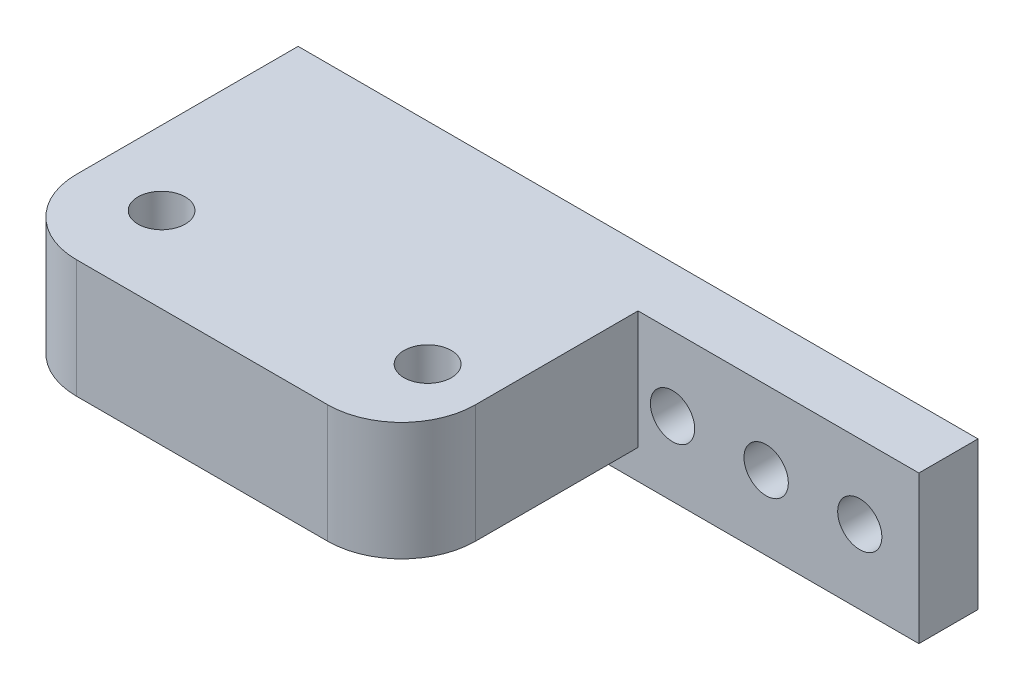
ISO-10303-21;
HEADER;
FILE_DESCRIPTION(('STEP AP214'),'2;1');
FILE_NAME('part.step','',(''),(''),'','','');
FILE_SCHEMA(('AUTOMOTIVE_DESIGN { 1 0 10303 214 1 1 1 1 }'));
ENDSEC;
DATA;
#1=APPLICATION_CONTEXT('core data for automotive mechanical design processes');
#2=APPLICATION_PROTOCOL_DEFINITION('international standard','automotive_design',2000,#1);
#3=PRODUCT_CONTEXT('',#1,'mechanical');
#4=PRODUCT('Part','Part','',(#3));
#5=PRODUCT_RELATED_PRODUCT_CATEGORY('part','',(#4));
#6=PRODUCT_DEFINITION_FORMATION('','',#4);
#7=PRODUCT_DEFINITION_CONTEXT('part definition',#1,'design');
#8=PRODUCT_DEFINITION('design','',#6,#7);
#9=PRODUCT_DEFINITION_SHAPE('','',#8);
#10=(LENGTH_UNIT() NAMED_UNIT(*) SI_UNIT(.MILLI.,.METRE.));
#11=(NAMED_UNIT(*) PLANE_ANGLE_UNIT() SI_UNIT($,.RADIAN.));
#12=(NAMED_UNIT(*) SI_UNIT($,.STERADIAN.) SOLID_ANGLE_UNIT());
#13=UNCERTAINTY_MEASURE_WITH_UNIT(LENGTH_MEASURE(1.E-05),#10,'distance_accuracy_value','');
#14=(GEOMETRIC_REPRESENTATION_CONTEXT(3) GLOBAL_UNCERTAINTY_ASSIGNED_CONTEXT((#13)) GLOBAL_UNIT_ASSIGNED_CONTEXT((#10,
#11,#12)) REPRESENTATION_CONTEXT('',''));
#15=CARTESIAN_POINT('',(0.,0.,0.));
#16=DIRECTION('',(0.,0.,1.));
#17=DIRECTION('',(1.,0.,0.));
#18=AXIS2_PLACEMENT_3D('',#15,#16,#17);
#19=CARTESIAN_POINT('',(0.,0.,4.));
#20=DIRECTION('',(0.,1.,0.));
#21=DIRECTION('',(0.,0.,1.));
#22=AXIS2_PLACEMENT_3D('',#19,#20,#21);
#23=PLANE('',#22);
#24=DIRECTION('',(1.,0.,0.));
#25=VECTOR('',#24,1.);
#26=CARTESIAN_POINT('',(0.,0.,0.));
#27=LINE('',#26,#25);
#28=CARTESIAN_POINT('',(0.,0.,0.));
#29=VERTEX_POINT('',#28);
#30=CARTESIAN_POINT('',(46.,0.,0.));
#31=VERTEX_POINT('',#30);
#32=EDGE_CURVE('E134',#29,#31,#27,.T.);
#33=ORIENTED_EDGE('',*,*,#32,.T.);
#34=DIRECTION('',(0.,0.,-1.));
#35=VECTOR('',#34,1.);
#36=CARTESIAN_POINT('',(46.,0.,4.));
#37=LINE('',#36,#35);
#38=CARTESIAN_POINT('',(46.,0.,4.));
#39=VERTEX_POINT('',#38);
#40=EDGE_CURVE('E160',#39,#31,#37,.T.);
#41=ORIENTED_EDGE('',*,*,#40,.F.);
#42=DIRECTION('',(1.,0.,0.));
#43=VECTOR('',#42,1.);
#44=CARTESIAN_POINT('',(0.,0.,4.));
#45=LINE('',#44,#43);
#46=CARTESIAN_POINT('',(0.,0.,4.));
#47=VERTEX_POINT('',#46);
#48=EDGE_CURVE('E135',#47,#39,#45,.T.);
#49=ORIENTED_EDGE('',*,*,#48,.F.);
#50=DIRECTION('',(0.,0.,-1.));
#51=VECTOR('',#50,1.);
#52=CARTESIAN_POINT('',(0.,0.,4.));
#53=LINE('',#52,#51);
#54=EDGE_CURVE('E144',#47,#29,#53,.T.);
#55=ORIENTED_EDGE('',*,*,#54,.T.);
#56=EDGE_LOOP('',(#33,#41,#49,#55));
#57=FACE_BOUND('',#56,.T.);
#58=ADVANCED_FACE('F33',(#57),#23,.F.);
#59=CARTESIAN_POINT('',(46.,0.,4.));
#60=DIRECTION('',(-1.,0.,0.));
#61=DIRECTION('',(0.,-1.,0.));
#62=AXIS2_PLACEMENT_3D('',#59,#60,#61);
#63=PLANE('',#62);
#64=DIRECTION('',(0.,1.,0.));
#65=VECTOR('',#64,1.);
#66=CARTESIAN_POINT('',(46.,0.,0.));
#67=LINE('',#66,#65);
#68=CARTESIAN_POINT('',(46.,10.,0.));
#69=VERTEX_POINT('',#68);
#70=EDGE_CURVE('E147',#31,#69,#67,.T.);
#71=ORIENTED_EDGE('',*,*,#70,.T.);
#72=DIRECTION('',(0.,0.,-1.));
#73=VECTOR('',#72,1.);
#74=CARTESIAN_POINT('',(46.,10.,4.));
#75=LINE('',#74,#73);
#76=CARTESIAN_POINT('',(46.,10.,4.));
#77=VERTEX_POINT('',#76);
#78=EDGE_CURVE('E158',#77,#69,#75,.T.);
#79=ORIENTED_EDGE('',*,*,#78,.F.);
#80=DIRECTION('',(0.,1.,0.));
#81=VECTOR('',#80,1.);
#82=CARTESIAN_POINT('',(46.,0.,4.));
#83=LINE('',#82,#81);
#84=EDGE_CURVE('E138',#39,#77,#83,.T.);
#85=ORIENTED_EDGE('',*,*,#84,.F.);
#86=ORIENTED_EDGE('',*,*,#40,.T.);
#87=EDGE_LOOP('',(#71,#79,#85,#86));
#88=FACE_BOUND('',#87,.T.);
#89=ADVANCED_FACE('F201',(#88),#63,.F.);
#90=CARTESIAN_POINT('',(0.,10.,4.));
#91=DIRECTION('',(0.,1.,0.));
#92=DIRECTION('',(0.,0.,1.));
#93=AXIS2_PLACEMENT_3D('',#90,#91,#92);
#94=PLANE('',#93);
#95=CARTESIAN_POINT('',(22.999560123497,10.,14.2359301666111));
#96=DIRECTION('',(0.,1.,0.));
#97=DIRECTION('',(0.,0.,1.));
#98=AXIS2_PLACEMENT_3D('',#95,#96,#97);
#99=CIRCLE('',#98,1.6009934289539);
#100=CARTESIAN_POINT('',(22.999560123497,10.,15.836923595565));
#101=VERTEX_POINT('',#100);
#102=EDGE_CURVE('E123',#101,#101,#99,.T.);
#103=ORIENTED_EDGE('',*,*,#102,.F.);
#104=EDGE_LOOP('',(#103));
#105=FACE_BOUND('',#104,.T.);
#106=CARTESIAN_POINT('',(5.0014415528665,10.,14.2376154244188));
#107=DIRECTION('',(0.,1.,0.));
#108=DIRECTION('',(0.,0.,1.));
#109=AXIS2_PLACEMENT_3D('',#106,#107,#108);
#110=CIRCLE('',#109,1.59816028140298);
#111=CARTESIAN_POINT('',(5.0014415528665,10.,15.8357757058218));
#112=VERTEX_POINT('',#111);
#113=EDGE_CURVE('E126',#112,#112,#110,.T.);
#114=ORIENTED_EDGE('',*,*,#113,.F.);
#115=EDGE_LOOP('',(#114));
#116=FACE_BOUND('',#115,.T.);
#117=DIRECTION('',(-1.,0.,0.));
#118=VECTOR('',#117,1.);
#119=CARTESIAN_POINT('',(0.,10.,20.));
#120=LINE('',#119,#118);
#121=CARTESIAN_POINT('',(22.,10.,20.));
#122=VERTEX_POINT('',#121);
#123=CARTESIAN_POINT('',(4.99999999999999,10.,20.));
#124=VERTEX_POINT('',#123);
#125=EDGE_CURVE('E129',#122,#124,#120,.T.);
#126=ORIENTED_EDGE('',*,*,#125,.F.);
#127=CARTESIAN_POINT('',(22.,10.,15.));
#128=DIRECTION('',(0.,1.,0.));
#129=DIRECTION('',(0.,0.,1.));
#130=AXIS2_PLACEMENT_3D('',#127,#128,#129);
#131=CIRCLE('',#130,5.);
#132=CARTESIAN_POINT('',(27.,10.,15.));
#133=VERTEX_POINT('',#132);
#134=EDGE_CURVE('E171',#122,#133,#131,.T.);
#135=ORIENTED_EDGE('',*,*,#134,.T.);
#136=DIRECTION('',(0.,0.,-1.));
#137=VECTOR('',#136,1.);
#138=CARTESIAN_POINT('',(27.,10.,20.));
#139=LINE('',#138,#137);
#140=CARTESIAN_POINT('',(27.,10.,4.));
#141=VERTEX_POINT('',#140);
#142=EDGE_CURVE('E109',#133,#141,#139,.T.);
#143=ORIENTED_EDGE('',*,*,#142,.T.);
#144=DIRECTION('',(1.,0.,0.));
#145=VECTOR('',#144,1.);
#146=CARTESIAN_POINT('',(0.,10.,4.));
#147=LINE('',#146,#145);
#148=EDGE_CURVE('E119',#141,#77,#147,.T.);
#149=ORIENTED_EDGE('',*,*,#148,.T.);
#150=ORIENTED_EDGE('',*,*,#78,.T.);
#151=DIRECTION('',(1.,0.,0.));
#152=VECTOR('',#151,1.);
#153=CARTESIAN_POINT('',(0.,10.,0.));
#154=LINE('',#153,#152);
#155=CARTESIAN_POINT('',(0.,10.,0.));
#156=VERTEX_POINT('',#155);
#157=EDGE_CURVE('E150',#156,#69,#154,.T.);
#158=ORIENTED_EDGE('',*,*,#157,.F.);
#159=DIRECTION('',(0.,0.,-1.));
#160=VECTOR('',#159,1.);
#161=CARTESIAN_POINT('',(0.,10.,4.));
#162=LINE('',#161,#160);
#163=CARTESIAN_POINT('',(0.,10.,15.));
#164=VERTEX_POINT('',#163);
#165=EDGE_CURVE('E156',#164,#156,#162,.T.);
#166=ORIENTED_EDGE('',*,*,#165,.F.);
#167=CARTESIAN_POINT('',(4.99999999999999,10.,15.));
#168=DIRECTION('',(0.,1.,0.));
#169=DIRECTION('',(0.,0.,1.));
#170=AXIS2_PLACEMENT_3D('',#167,#168,#169);
#171=CIRCLE('',#170,5.);
#172=EDGE_CURVE('E169',#164,#124,#171,.T.);
#173=ORIENTED_EDGE('',*,*,#172,.T.);
#174=EDGE_LOOP('',(#126,#135,#143,#149,#150,#158,#166,#173));
#175=FACE_BOUND('',#174,.T.);
#176=ADVANCED_FACE('F184',(#105,#116,#175),#94,.T.);
#177=CARTESIAN_POINT('',(0.,0.,4.));
#178=DIRECTION('',(-1.,0.,0.));
#179=DIRECTION('',(0.,-1.,0.));
#180=AXIS2_PLACEMENT_3D('',#177,#178,#179);
#181=PLANE('',#180);
#182=DIRECTION('',(0.,0.,-1.));
#183=VECTOR('',#182,1.);
#184=CARTESIAN_POINT('',(0.,2.,20.));
#185=LINE('',#184,#183);
#186=CARTESIAN_POINT('',(0.,2.,15.));
#187=VERTEX_POINT('',#186);
#188=CARTESIAN_POINT('',(0.,2.,4.));
#189=VERTEX_POINT('',#188);
#190=EDGE_CURVE('E108',#187,#189,#185,.T.);
#191=ORIENTED_EDGE('',*,*,#190,.F.);
#192=DIRECTION('',(0.,-1.,0.));
#193=VECTOR('',#192,1.);
#194=CARTESIAN_POINT('',(0.,0.,15.));
#195=LINE('',#194,#193);
#196=EDGE_CURVE('E11',#187,#164,#195,.F.);
#197=ORIENTED_EDGE('',*,*,#196,.T.);
#198=ORIENTED_EDGE('',*,*,#165,.T.);
#199=DIRECTION('',(0.,1.,0.));
#200=VECTOR('',#199,1.);
#201=CARTESIAN_POINT('',(0.,0.,0.));
#202=LINE('',#201,#200);
#203=EDGE_CURVE('E139',#29,#156,#202,.T.);
#204=ORIENTED_EDGE('',*,*,#203,.F.);
#205=ORIENTED_EDGE('',*,*,#54,.F.);
#206=DIRECTION('',(0.,1.,0.));
#207=VECTOR('',#206,1.);
#208=CARTESIAN_POINT('',(0.,0.,4.));
#209=LINE('',#208,#207);
#210=EDGE_CURVE('E142',#47,#189,#209,.T.);
#211=ORIENTED_EDGE('',*,*,#210,.T.);
#212=EDGE_LOOP('',(#191,#197,#198,#204,#205,#211));
#213=FACE_BOUND('',#212,.T.);
#214=ADVANCED_FACE('F190',(#213),#181,.T.);
#215=CARTESIAN_POINT('',(0.,0.,4.));
#216=DIRECTION('',(0.,0.,1.));
#217=DIRECTION('',(1.,0.,0.));
#218=AXIS2_PLACEMENT_3D('',#215,#216,#217);
#219=PLANE('',#218);
#220=CARTESIAN_POINT('',(41.9999999999998,5.00000000000299,4.));
#221=DIRECTION('',(0.,0.,1.));
#222=DIRECTION('',(1.,0.,0.));
#223=AXIS2_PLACEMENT_3D('',#220,#221,#222);
#224=CIRCLE('',#223,1.49482083831928);
#225=CARTESIAN_POINT('',(43.4948208383191,5.00000000000299,4.));
#226=VERTEX_POINT('',#225);
#227=EDGE_CURVE('E372',#226,#226,#224,.T.);
#228=ORIENTED_EDGE('',*,*,#227,.F.);
#229=EDGE_LOOP('',(#228));
#230=FACE_BOUND('',#229,.T.);
#231=CARTESIAN_POINT('',(29.3333333333331,5.00000000000299,4.));
#232=DIRECTION('',(0.,0.,1.));
#233=DIRECTION('',(1.,0.,0.));
#234=AXIS2_PLACEMENT_3D('',#231,#232,#233);
#235=CIRCLE('',#234,1.49999999999984);
#236=CARTESIAN_POINT('',(30.833333333333,5.00000000000299,4.));
#237=VERTEX_POINT('',#236);
#238=EDGE_CURVE('E369',#237,#237,#235,.T.);
#239=ORIENTED_EDGE('',*,*,#238,.F.);
#240=EDGE_LOOP('',(#239));
#241=FACE_BOUND('',#240,.T.);
#242=CARTESIAN_POINT('',(35.6666666666664,5.00000000000299,4.));
#243=DIRECTION('',(0.,0.,1.));
#244=DIRECTION('',(1.,0.,0.));
#245=AXIS2_PLACEMENT_3D('',#242,#243,#244);
#246=CIRCLE('',#245,1.49999999999985);
#247=CARTESIAN_POINT('',(37.1666666666663,5.00000000000299,4.));
#248=VERTEX_POINT('',#247);
#249=EDGE_CURVE('E366',#248,#248,#246,.T.);
#250=ORIENTED_EDGE('',*,*,#249,.F.);
#251=EDGE_LOOP('',(#250));
#252=FACE_BOUND('',#251,.T.);
#253=DIRECTION('',(0.,1.,0.));
#254=VECTOR('',#253,1.);
#255=CARTESIAN_POINT('',(27.,10.,4.));
#256=LINE('',#255,#254);
#257=CARTESIAN_POINT('',(27.,2.,4.));
#258=VERTEX_POINT('',#257);
#259=EDGE_CURVE('E105',#258,#141,#256,.T.);
#260=ORIENTED_EDGE('',*,*,#259,.F.);
#261=DIRECTION('',(1.,0.,0.));
#262=VECTOR('',#261,1.);
#263=CARTESIAN_POINT('',(0.,2.,4.));
#264=LINE('',#263,#262);
#265=EDGE_CURVE('E116',#189,#258,#264,.T.);
#266=ORIENTED_EDGE('',*,*,#265,.F.);
#267=ORIENTED_EDGE('',*,*,#210,.F.);
#268=ORIENTED_EDGE('',*,*,#48,.T.);
#269=ORIENTED_EDGE('',*,*,#84,.T.);
#270=ORIENTED_EDGE('',*,*,#148,.F.);
#271=EDGE_LOOP('',(#260,#266,#267,#268,#269,#270));
#272=FACE_BOUND('',#271,.T.);
#273=ADVANCED_FACE('F114',(#230,#241,#252,#272),#219,.T.);
#274=CARTESIAN_POINT('',(0.,0.,0.));
#275=DIRECTION('',(0.,0.,1.));
#276=DIRECTION('',(1.,0.,0.));
#277=AXIS2_PLACEMENT_3D('',#274,#275,#276);
#278=PLANE('',#277);
#279=CARTESIAN_POINT('',(41.9999999999998,5.00000000000299,0.));
#280=DIRECTION('',(0.,0.,-1.));
#281=DIRECTION('',(-1.,0.,0.));
#282=AXIS2_PLACEMENT_3D('',#279,#280,#281);
#283=CIRCLE('',#282,1.49482083831928);
#284=CARTESIAN_POINT('',(40.5051791616805,5.00000000000299,0.));
#285=VERTEX_POINT('',#284);
#286=EDGE_CURVE('E353',#285,#285,#283,.T.);
#287=ORIENTED_EDGE('',*,*,#286,.F.);
#288=EDGE_LOOP('',(#287));
#289=FACE_BOUND('',#288,.T.);
#290=CARTESIAN_POINT('',(29.3333333333331,5.00000000000299,0.));
#291=DIRECTION('',(0.,0.,-1.));
#292=DIRECTION('',(-1.,0.,0.));
#293=AXIS2_PLACEMENT_3D('',#290,#291,#292);
#294=CIRCLE('',#293,1.49999999999984);
#295=CARTESIAN_POINT('',(27.8333333333333,5.00000000000299,0.));
#296=VERTEX_POINT('',#295);
#297=EDGE_CURVE('E357',#296,#296,#294,.T.);
#298=ORIENTED_EDGE('',*,*,#297,.F.);
#299=EDGE_LOOP('',(#298));
#300=FACE_BOUND('',#299,.T.);
#301=CARTESIAN_POINT('',(35.6666666666664,5.00000000000299,0.));
#302=DIRECTION('',(0.,0.,-1.));
#303=DIRECTION('',(-1.,0.,0.));
#304=AXIS2_PLACEMENT_3D('',#301,#302,#303);
#305=CIRCLE('',#304,1.49999999999985);
#306=CARTESIAN_POINT('',(34.1666666666666,5.00000000000299,0.));
#307=VERTEX_POINT('',#306);
#308=EDGE_CURVE('E360',#307,#307,#305,.T.);
#309=ORIENTED_EDGE('',*,*,#308,.F.);
#310=EDGE_LOOP('',(#309));
#311=FACE_BOUND('',#310,.T.);
#312=ORIENTED_EDGE('',*,*,#32,.F.);
#313=ORIENTED_EDGE('',*,*,#203,.T.);
#314=ORIENTED_EDGE('',*,*,#157,.T.);
#315=ORIENTED_EDGE('',*,*,#70,.F.);
#316=EDGE_LOOP('',(#312,#313,#314,#315));
#317=FACE_BOUND('',#316,.T.);
#318=ADVANCED_FACE('F196',(#289,#300,#311,#317),#278,.F.);
#319=CARTESIAN_POINT('',(0.,2.,20.));
#320=DIRECTION('',(0.,1.,0.));
#321=DIRECTION('',(0.,0.,1.));
#322=AXIS2_PLACEMENT_3D('',#319,#320,#321);
#323=PLANE('',#322);
#324=CARTESIAN_POINT('',(22.999560123497,2.,14.2359301666111));
#325=DIRECTION('',(0.,-1.,0.));
#326=DIRECTION('',(0.,0.,-1.));
#327=AXIS2_PLACEMENT_3D('',#324,#325,#326);
#328=CIRCLE('',#327,1.6009934289539);
#329=CARTESIAN_POINT('',(22.999560123497,2.,12.6349367376572));
#330=VERTEX_POINT('',#329);
#331=EDGE_CURVE('E375',#330,#330,#328,.T.);
#332=ORIENTED_EDGE('',*,*,#331,.F.);
#333=EDGE_LOOP('',(#332));
#334=FACE_BOUND('',#333,.T.);
#335=CARTESIAN_POINT('',(5.0014415528665,2.,14.2376154244188));
#336=DIRECTION('',(0.,-1.,0.));
#337=DIRECTION('',(0.,0.,-1.));
#338=AXIS2_PLACEMENT_3D('',#335,#336,#337);
#339=CIRCLE('',#338,1.59816028140298);
#340=CARTESIAN_POINT('',(5.0014415528665,2.,12.6394551430158));
#341=VERTEX_POINT('',#340);
#342=EDGE_CURVE('E374',#341,#341,#339,.T.);
#343=ORIENTED_EDGE('',*,*,#342,.F.);
#344=EDGE_LOOP('',(#343));
#345=FACE_BOUND('',#344,.T.);
#346=DIRECTION('',(0.,0.,-1.));
#347=VECTOR('',#346,1.);
#348=CARTESIAN_POINT('',(27.,2.,20.));
#349=LINE('',#348,#347);
#350=CARTESIAN_POINT('',(27.,2.,15.));
#351=VERTEX_POINT('',#350);
#352=EDGE_CURVE('E102',#351,#258,#349,.T.);
#353=ORIENTED_EDGE('',*,*,#352,.F.);
#354=CARTESIAN_POINT('',(22.,2.,15.));
#355=DIRECTION('',(0.,1.,0.));
#356=DIRECTION('',(0.,0.,1.));
#357=AXIS2_PLACEMENT_3D('',#354,#355,#356);
#358=CIRCLE('',#357,5.);
#359=CARTESIAN_POINT('',(22.,2.,20.));
#360=VERTEX_POINT('',#359);
#361=EDGE_CURVE('E41',#351,#360,#358,.F.);
#362=ORIENTED_EDGE('',*,*,#361,.T.);
#363=DIRECTION('',(1.,0.,0.));
#364=VECTOR('',#363,1.);
#365=CARTESIAN_POINT('',(0.,2.,20.));
#366=LINE('',#365,#364);
#367=CARTESIAN_POINT('',(5.,2.,20.));
#368=VERTEX_POINT('',#367);
#369=EDGE_CURVE('E120',#368,#360,#366,.T.);
#370=ORIENTED_EDGE('',*,*,#369,.F.);
#371=CARTESIAN_POINT('',(5.,2.,15.));
#372=DIRECTION('',(0.,1.,0.));
#373=DIRECTION('',(0.,0.,1.));
#374=AXIS2_PLACEMENT_3D('',#371,#372,#373);
#375=CIRCLE('',#374,5.);
#376=EDGE_CURVE('E48',#368,#187,#375,.F.);
#377=ORIENTED_EDGE('',*,*,#376,.T.);
#378=ORIENTED_EDGE('',*,*,#190,.T.);
#379=ORIENTED_EDGE('',*,*,#265,.T.);
#380=EDGE_LOOP('',(#353,#362,#370,#377,#378,#379));
#381=FACE_BOUND('',#380,.T.);
#382=ADVANCED_FACE('F122',(#334,#345,#381),#323,.F.);
#383=CARTESIAN_POINT('',(27.,10.,20.));
#384=DIRECTION('',(-1.,0.,0.));
#385=DIRECTION('',(0.,0.,1.));
#386=AXIS2_PLACEMENT_3D('',#383,#384,#385);
#387=PLANE('',#386);
#388=ORIENTED_EDGE('',*,*,#142,.F.);
#389=DIRECTION('',(0.,1.,0.));
#390=VECTOR('',#389,1.);
#391=CARTESIAN_POINT('',(27.,2.,15.));
#392=LINE('',#391,#390);
#393=EDGE_CURVE('E56',#133,#351,#392,.F.);
#394=ORIENTED_EDGE('',*,*,#393,.T.);
#395=ORIENTED_EDGE('',*,*,#352,.T.);
#396=ORIENTED_EDGE('',*,*,#259,.T.);
#397=EDGE_LOOP('',(#388,#394,#395,#396));
#398=FACE_BOUND('',#397,.T.);
#399=ADVANCED_FACE('F104',(#398),#387,.F.);
#400=CARTESIAN_POINT('',(0.,0.,20.));
#401=DIRECTION('',(0.,0.,1.));
#402=DIRECTION('',(1.,0.,0.));
#403=AXIS2_PLACEMENT_3D('',#400,#401,#402);
#404=PLANE('',#403);
#405=ORIENTED_EDGE('',*,*,#369,.T.);
#406=DIRECTION('',(0.,1.,0.));
#407=VECTOR('',#406,1.);
#408=CARTESIAN_POINT('',(22.,10.,20.));
#409=LINE('',#408,#407);
#410=EDGE_CURVE('E166',#360,#122,#409,.T.);
#411=ORIENTED_EDGE('',*,*,#410,.T.);
#412=ORIENTED_EDGE('',*,*,#125,.T.);
#413=DIRECTION('',(0.,-1.,0.));
#414=VECTOR('',#413,1.);
#415=CARTESIAN_POINT('',(5.,0.,20.));
#416=LINE('',#415,#414);
#417=EDGE_CURVE('E163',#124,#368,#416,.T.);
#418=ORIENTED_EDGE('',*,*,#417,.T.);
#419=EDGE_LOOP('',(#405,#411,#412,#418));
#420=FACE_BOUND('',#419,.T.);
#421=ADVANCED_FACE('F178',(#420),#404,.T.);
#422=CARTESIAN_POINT('',(5.0014415528665,18.,14.2376154244188));
#423=DIRECTION('',(0.,-1.,0.));
#424=DIRECTION('',(0.,0.,-1.));
#425=AXIS2_PLACEMENT_3D('',#422,#423,#424);
#426=CYLINDRICAL_SURFACE('',#425,1.59816028140298);
#427=ORIENTED_EDGE('',*,*,#113,.T.);
#428=EDGE_LOOP('',(#427));
#429=FACE_BOUND('',#428,.T.);
#430=ORIENTED_EDGE('',*,*,#342,.T.);
#431=EDGE_LOOP('',(#430));
#432=FACE_BOUND('',#431,.T.);
#433=ADVANCED_FACE('F237',(#429,#432),#426,.F.);
#434=CARTESIAN_POINT('',(22.999560123497,18.,14.2359301666111));
#435=DIRECTION('',(0.,-1.,0.));
#436=DIRECTION('',(0.,0.,-1.));
#437=AXIS2_PLACEMENT_3D('',#434,#435,#436);
#438=CYLINDRICAL_SURFACE('',#437,1.6009934289539);
#439=ORIENTED_EDGE('',*,*,#102,.T.);
#440=EDGE_LOOP('',(#439));
#441=FACE_BOUND('',#440,.T.);
#442=ORIENTED_EDGE('',*,*,#331,.T.);
#443=EDGE_LOOP('',(#442));
#444=FACE_BOUND('',#443,.T.);
#445=ADVANCED_FACE('F233',(#441,#444),#438,.F.);
#446=CARTESIAN_POINT('',(35.6666666666664,5.00000000000299,16.));
#447=DIRECTION('',(0.,0.,-1.));
#448=DIRECTION('',(-1.,0.,0.));
#449=AXIS2_PLACEMENT_3D('',#446,#447,#448);
#450=CYLINDRICAL_SURFACE('',#449,1.49999999999985);
#451=ORIENTED_EDGE('',*,*,#249,.T.);
#452=EDGE_LOOP('',(#451));
#453=FACE_BOUND('',#452,.T.);
#454=ORIENTED_EDGE('',*,*,#308,.T.);
#455=EDGE_LOOP('',(#454));
#456=FACE_BOUND('',#455,.T.);
#457=ADVANCED_FACE('F225',(#453,#456),#450,.F.);
#458=CARTESIAN_POINT('',(29.3333333333331,5.00000000000299,16.));
#459=DIRECTION('',(0.,0.,-1.));
#460=DIRECTION('',(-1.,0.,0.));
#461=AXIS2_PLACEMENT_3D('',#458,#459,#460);
#462=CYLINDRICAL_SURFACE('',#461,1.49999999999984);
#463=ORIENTED_EDGE('',*,*,#238,.T.);
#464=EDGE_LOOP('',(#463));
#465=FACE_BOUND('',#464,.T.);
#466=ORIENTED_EDGE('',*,*,#297,.T.);
#467=EDGE_LOOP('',(#466));
#468=FACE_BOUND('',#467,.T.);
#469=ADVANCED_FACE('F219',(#465,#468),#462,.F.);
#470=CARTESIAN_POINT('',(41.9999999999998,5.00000000000299,16.));
#471=DIRECTION('',(0.,0.,-1.));
#472=DIRECTION('',(-1.,0.,0.));
#473=AXIS2_PLACEMENT_3D('',#470,#471,#472);
#474=CYLINDRICAL_SURFACE('',#473,1.49482083831928);
#475=ORIENTED_EDGE('',*,*,#227,.T.);
#476=EDGE_LOOP('',(#475));
#477=FACE_BOUND('',#476,.T.);
#478=ORIENTED_EDGE('',*,*,#286,.T.);
#479=EDGE_LOOP('',(#478));
#480=FACE_BOUND('',#479,.T.);
#481=ADVANCED_FACE('F214',(#477,#480),#474,.F.);
#482=CARTESIAN_POINT('',(22.,0.,15.));
#483=DIRECTION('',(0.,-1.,0.));
#484=DIRECTION('',(0.,0.,-1.));
#485=AXIS2_PLACEMENT_3D('',#482,#483,#484);
#486=CYLINDRICAL_SURFACE('',#485,5.);
#487=ORIENTED_EDGE('',*,*,#361,.F.);
#488=ORIENTED_EDGE('',*,*,#393,.F.);
#489=ORIENTED_EDGE('',*,*,#134,.F.);
#490=ORIENTED_EDGE('',*,*,#410,.F.);
#491=EDGE_LOOP('',(#487,#488,#489,#490));
#492=FACE_BOUND('',#491,.T.);
#493=ADVANCED_FACE('F182',(#492),#486,.T.);
#494=CARTESIAN_POINT('',(5.,0.,15.));
#495=DIRECTION('',(0.,-1.,0.));
#496=DIRECTION('',(1.,0.,0.));
#497=AXIS2_PLACEMENT_3D('',#494,#495,#496);
#498=CYLINDRICAL_SURFACE('',#497,5.);
#499=ORIENTED_EDGE('',*,*,#172,.F.);
#500=ORIENTED_EDGE('',*,*,#196,.F.);
#501=ORIENTED_EDGE('',*,*,#376,.F.);
#502=ORIENTED_EDGE('',*,*,#417,.F.);
#503=EDGE_LOOP('',(#499,#500,#501,#502));
#504=FACE_BOUND('',#503,.T.);
#505=ADVANCED_FACE('F35',(#504),#498,.T.);
#506=CLOSED_SHELL('',(#58,#89,#176,#214,#273,#318,#382,#399,#421,#433,#445,#457,#469,#481,#493,#505));
#507=MANIFOLD_SOLID_BREP('B2',#506);
#508=ADVANCED_BREP_SHAPE_REPRESENTATION('',(#18,#507),#14);
#509=SHAPE_DEFINITION_REPRESENTATION(#9,#508);
ENDSEC;
END-ISO-10303-21;
